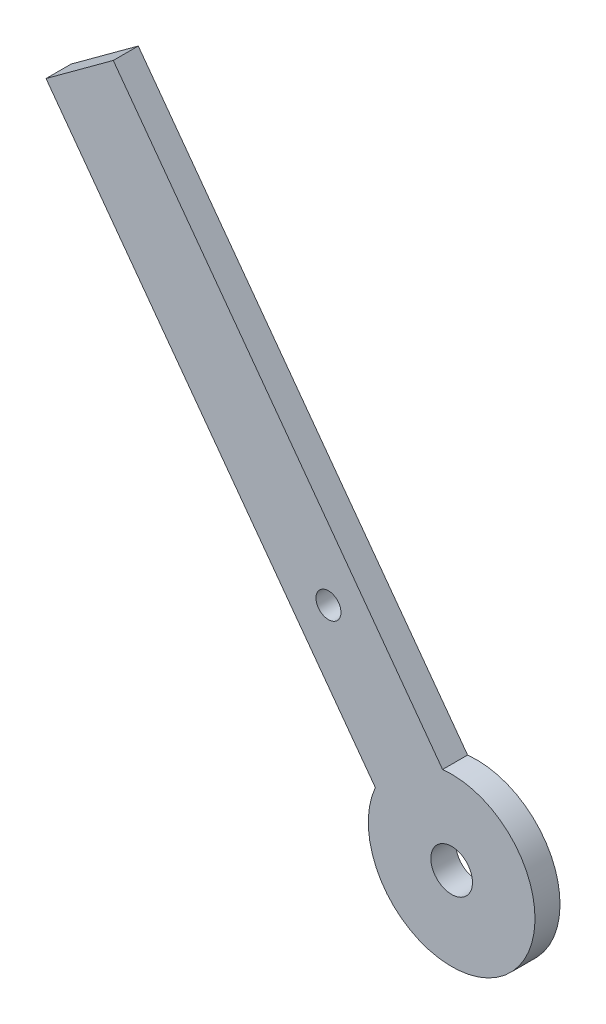
ISO-10303-21;
HEADER;
FILE_DESCRIPTION(('STEP AP214'),'2;1');
FILE_NAME('part.step','',(''),(''),'','','');
FILE_SCHEMA(('AUTOMOTIVE_DESIGN { 1 0 10303 214 1 1 1 1 }'));
ENDSEC;
DATA;
#1=APPLICATION_CONTEXT('core data for automotive mechanical design processes');
#2=APPLICATION_PROTOCOL_DEFINITION('international standard','automotive_design',2000,#1);
#3=PRODUCT_CONTEXT('',#1,'mechanical');
#4=PRODUCT('Part','Part','',(#3));
#5=PRODUCT_RELATED_PRODUCT_CATEGORY('part','',(#4));
#6=PRODUCT_DEFINITION_FORMATION('','',#4);
#7=PRODUCT_DEFINITION_CONTEXT('part definition',#1,'design');
#8=PRODUCT_DEFINITION('design','',#6,#7);
#9=PRODUCT_DEFINITION_SHAPE('','',#8);
#10=(LENGTH_UNIT() NAMED_UNIT(*) SI_UNIT(.MILLI.,.METRE.));
#11=(NAMED_UNIT(*) PLANE_ANGLE_UNIT() SI_UNIT($,.RADIAN.));
#12=(NAMED_UNIT(*) SI_UNIT($,.STERADIAN.) SOLID_ANGLE_UNIT());
#13=UNCERTAINTY_MEASURE_WITH_UNIT(LENGTH_MEASURE(1.E-05),#10,'distance_accuracy_value','');
#14=(GEOMETRIC_REPRESENTATION_CONTEXT(3) GLOBAL_UNCERTAINTY_ASSIGNED_CONTEXT((#13)) GLOBAL_UNIT_ASSIGNED_CONTEXT((#10,
#11,#12)) REPRESENTATION_CONTEXT('',''));
#15=CARTESIAN_POINT('',(0.,0.,0.));
#16=DIRECTION('',(0.,0.,1.));
#17=DIRECTION('',(1.,0.,0.));
#18=AXIS2_PLACEMENT_3D('',#15,#16,#17);
#19=CARTESIAN_POINT('',(52.8899948849438,53.8785527002225,3.));
#20=DIRECTION('',(0.,0.,1.));
#21=DIRECTION('',(1.,0.,0.));
#22=AXIS2_PLACEMENT_3D('',#19,#20,#21);
#23=PLANE('',#22);
#24=CARTESIAN_POINT('',(52.8899948849438,53.8785527002225,3.));
#25=DIRECTION('',(0.,0.,1.));
#26=DIRECTION('',(1.,0.,0.));
#27=AXIS2_PLACEMENT_3D('',#24,#25,#26);
#28=CIRCLE('',#27,2.49999999988457);
#29=CARTESIAN_POINT('',(55.3899948848284,53.8785527002225,3.));
#30=VERTEX_POINT('',#29);
#31=EDGE_CURVE('E101',#30,#30,#28,.T.);
#32=ORIENTED_EDGE('',*,*,#31,.F.);
#33=EDGE_LOOP('',(#32));
#34=FACE_BOUND('',#33,.T.);
#35=DIRECTION('',(-0.806588676447804,-0.591113108487859,0.));
#36=VECTOR('',#35,1.);
#37=CARTESIAN_POINT('',(8.26095519410983,114.775997772031,3.));
#38=LINE('',#37,#36);
#39=CARTESIAN_POINT('',(12.2938985763487,117.731563314471,3.));
#40=VERTEX_POINT('',#39);
#41=CARTESIAN_POINT('',(4.22801181186988,111.820432229591,3.));
#42=VERTEX_POINT('',#41);
#43=EDGE_CURVE('E81',#40,#42,#38,.T.);
#44=ORIENTED_EDGE('',*,*,#43,.T.);
#45=DIRECTION('',(0.591113108487865,-0.8065886764478,0.));
#46=VECTOR('',#45,1.);
#47=CARTESIAN_POINT('',(4.22801181186988,111.820432229591,3.));
#48=LINE('',#47,#46);
#49=CARTESIAN_POINT('',(43.7378618180995,57.9082499998685,3.));
#50=VERTEX_POINT('',#49);
#51=EDGE_CURVE('E84',#42,#50,#48,.T.);
#52=ORIENTED_EDGE('',*,*,#51,.T.);
#53=CARTESIAN_POINT('',(52.8899948849438,53.8785527002225,3.));
#54=DIRECTION('',(0.,0.,1.));
#55=DIRECTION('',(1.,0.,0.));
#56=AXIS2_PLACEMENT_3D('',#53,#54,#55);
#57=CIRCLE('',#56,10.);
#58=CARTESIAN_POINT('',(51.8037485825779,63.8193810847484,3.));
#59=VERTEX_POINT('',#58);
#60=EDGE_CURVE('E88',#50,#59,#57,.T.);
#61=ORIENTED_EDGE('',*,*,#60,.T.);
#62=DIRECTION('',(-0.591113108487866,0.806588676447799,0.));
#63=VECTOR('',#62,1.);
#64=CARTESIAN_POINT('',(12.2938985763487,117.731563314471,3.));
#65=LINE('',#64,#63);
#66=EDGE_CURVE('E52',#59,#40,#65,.T.);
#67=ORIENTED_EDGE('',*,*,#66,.T.);
#68=EDGE_LOOP('',(#44,#52,#61,#67));
#69=FACE_BOUND('',#68,.T.);
#70=CARTESIAN_POINT('',(38.1121671727473,74.0432696114173,3.));
#71=DIRECTION('',(0.,0.,1.));
#72=DIRECTION('',(1.,0.,0.));
#73=AXIS2_PLACEMENT_3D('',#70,#71,#72);
#74=CIRCLE('',#73,1.50000000177059);
#75=CARTESIAN_POINT('',(39.6121671745179,74.0432696114173,3.));
#76=VERTEX_POINT('',#75);
#77=EDGE_CURVE('E122',#76,#76,#74,.T.);
#78=ORIENTED_EDGE('',*,*,#77,.F.);
#79=EDGE_LOOP('',(#78));
#80=FACE_BOUND('',#79,.T.);
#81=ADVANCED_FACE('F35',(#34,#69,#80),#23,.T.);
#82=CARTESIAN_POINT('',(52.8899948849438,53.8785527002225,0.));
#83=DIRECTION('',(0.,0.,1.));
#84=DIRECTION('',(1.,0.,0.));
#85=AXIS2_PLACEMENT_3D('',#82,#83,#84);
#86=PLANE('',#85);
#87=DIRECTION('',(-0.806588676447799,-0.591113108487866,0.));
#88=VECTOR('',#87,1.);
#89=CARTESIAN_POINT('',(8.26095519410983,114.775997772031,0.));
#90=LINE('',#89,#88);
#91=CARTESIAN_POINT('',(12.2938985763487,117.731563314471,0.));
#92=VERTEX_POINT('',#91);
#93=CARTESIAN_POINT('',(4.22801181186988,111.820432229591,0.));
#94=VERTEX_POINT('',#93);
#95=EDGE_CURVE('E76',#92,#94,#90,.T.);
#96=ORIENTED_EDGE('',*,*,#95,.F.);
#97=DIRECTION('',(-0.591113108487866,0.806588676447799,0.));
#98=VECTOR('',#97,1.);
#99=CARTESIAN_POINT('',(12.2938985763487,117.731563314471,0.));
#100=LINE('',#99,#98);
#101=CARTESIAN_POINT('',(51.8037485825779,63.8193810847484,0.));
#102=VERTEX_POINT('',#101);
#103=EDGE_CURVE('E104',#102,#92,#100,.T.);
#104=ORIENTED_EDGE('',*,*,#103,.F.);
#105=CARTESIAN_POINT('',(52.8899948849438,53.8785527002225,0.));
#106=DIRECTION('',(0.,0.,1.));
#107=DIRECTION('',(1.,0.,0.));
#108=AXIS2_PLACEMENT_3D('',#105,#106,#107);
#109=CIRCLE('',#108,10.);
#110=CARTESIAN_POINT('',(43.7378618180995,57.9082499998685,0.));
#111=VERTEX_POINT('',#110);
#112=EDGE_CURVE('E69',#111,#102,#109,.T.);
#113=ORIENTED_EDGE('',*,*,#112,.F.);
#114=DIRECTION('',(0.591113108487865,-0.8065886764478,0.));
#115=VECTOR('',#114,1.);
#116=CARTESIAN_POINT('',(4.22801181186988,111.820432229591,0.));
#117=LINE('',#116,#115);
#118=EDGE_CURVE('E92',#94,#111,#117,.T.);
#119=ORIENTED_EDGE('',*,*,#118,.F.);
#120=EDGE_LOOP('',(#96,#104,#113,#119));
#121=FACE_BOUND('',#120,.T.);
#122=CARTESIAN_POINT('',(52.8899948849438,53.8785527002225,0.));
#123=DIRECTION('',(0.,0.,1.));
#124=DIRECTION('',(1.,0.,0.));
#125=AXIS2_PLACEMENT_3D('',#122,#123,#124);
#126=CIRCLE('',#125,2.49999999988457);
#127=CARTESIAN_POINT('',(55.3899948848284,53.8785527002225,0.));
#128=VERTEX_POINT('',#127);
#129=EDGE_CURVE('E117',#128,#128,#126,.T.);
#130=ORIENTED_EDGE('',*,*,#129,.T.);
#131=EDGE_LOOP('',(#130));
#132=FACE_BOUND('',#131,.T.);
#133=CARTESIAN_POINT('',(38.1121671727473,74.0432696114173,0.));
#134=DIRECTION('',(0.,0.,1.));
#135=DIRECTION('',(1.,0.,0.));
#136=AXIS2_PLACEMENT_3D('',#133,#134,#135);
#137=CIRCLE('',#136,1.50000000177059);
#138=CARTESIAN_POINT('',(39.6121671745179,74.0432696114173,0.));
#139=VERTEX_POINT('',#138);
#140=EDGE_CURVE('E120',#139,#139,#137,.T.);
#141=ORIENTED_EDGE('',*,*,#140,.T.);
#142=EDGE_LOOP('',(#141));
#143=FACE_BOUND('',#142,.T.);
#144=ADVANCED_FACE('F110',(#121,#132,#143),#86,.F.);
#145=CARTESIAN_POINT('',(8.26095519410983,114.775997772031,3.));
#146=DIRECTION('',(0.591113108487866,-0.806588676447799,0.));
#147=DIRECTION('',(0.806588676447799,0.591113108487866,0.));
#148=AXIS2_PLACEMENT_3D('',#145,#146,#147);
#149=PLANE('',#148);
#150=ORIENTED_EDGE('',*,*,#95,.T.);
#151=DIRECTION('',(0.,0.,-1.));
#152=VECTOR('',#151,1.);
#153=CARTESIAN_POINT('',(4.22801181186988,111.820432229591,3.));
#154=LINE('',#153,#152);
#155=EDGE_CURVE('E11',#42,#94,#154,.T.);
#156=ORIENTED_EDGE('',*,*,#155,.F.);
#157=ORIENTED_EDGE('',*,*,#43,.F.);
#158=DIRECTION('',(0.,0.,-1.));
#159=VECTOR('',#158,1.);
#160=CARTESIAN_POINT('',(12.2938985763487,117.731563314471,3.));
#161=LINE('',#160,#159);
#162=EDGE_CURVE('E96',#40,#92,#161,.T.);
#163=ORIENTED_EDGE('',*,*,#162,.T.);
#164=EDGE_LOOP('',(#150,#156,#157,#163));
#165=FACE_BOUND('',#164,.T.);
#166=ADVANCED_FACE('F37',(#165),#149,.F.);
#167=CARTESIAN_POINT('',(4.22801181186988,111.820432229591,3.));
#168=DIRECTION('',(0.8065886764478,0.591113108487865,0.));
#169=DIRECTION('',(-0.591113108487865,0.8065886764478,0.));
#170=AXIS2_PLACEMENT_3D('',#167,#168,#169);
#171=PLANE('',#170);
#172=ORIENTED_EDGE('',*,*,#118,.T.);
#173=DIRECTION('',(0.,0.,-1.));
#174=VECTOR('',#173,1.);
#175=CARTESIAN_POINT('',(43.7378618180995,57.9082499998685,3.));
#176=LINE('',#175,#174);
#177=EDGE_CURVE('E44',#50,#111,#176,.T.);
#178=ORIENTED_EDGE('',*,*,#177,.F.);
#179=ORIENTED_EDGE('',*,*,#51,.F.);
#180=ORIENTED_EDGE('',*,*,#155,.T.);
#181=EDGE_LOOP('',(#172,#178,#179,#180));
#182=FACE_BOUND('',#181,.T.);
#183=ADVANCED_FACE('F91',(#182),#171,.F.);
#184=CARTESIAN_POINT('',(52.8899948849438,53.8785527002225,3.));
#185=DIRECTION('',(0.,0.,-1.));
#186=DIRECTION('',(-1.,0.,0.));
#187=AXIS2_PLACEMENT_3D('',#184,#185,#186);
#188=CYLINDRICAL_SURFACE('',#187,10.);
#189=ORIENTED_EDGE('',*,*,#112,.T.);
#190=DIRECTION('',(0.,0.,-1.));
#191=VECTOR('',#190,1.);
#192=CARTESIAN_POINT('',(51.8037485825779,63.8193810847484,3.));
#193=LINE('',#192,#191);
#194=EDGE_CURVE('E93',#59,#102,#193,.T.);
#195=ORIENTED_EDGE('',*,*,#194,.F.);
#196=ORIENTED_EDGE('',*,*,#60,.F.);
#197=ORIENTED_EDGE('',*,*,#177,.T.);
#198=EDGE_LOOP('',(#189,#195,#196,#197));
#199=FACE_BOUND('',#198,.T.);
#200=ADVANCED_FACE('F94',(#199),#188,.T.);
#201=CARTESIAN_POINT('',(12.2938985763487,117.731563314471,3.));
#202=DIRECTION('',(-0.806588676447799,-0.591113108487866,0.));
#203=DIRECTION('',(0.591113108487866,-0.8065886764478,0.));
#204=AXIS2_PLACEMENT_3D('',#201,#202,#203);
#205=PLANE('',#204);
#206=ORIENTED_EDGE('',*,*,#103,.T.);
#207=ORIENTED_EDGE('',*,*,#162,.F.);
#208=ORIENTED_EDGE('',*,*,#66,.F.);
#209=ORIENTED_EDGE('',*,*,#194,.T.);
#210=EDGE_LOOP('',(#206,#207,#208,#209));
#211=FACE_BOUND('',#210,.T.);
#212=ADVANCED_FACE('F109',(#211),#205,.F.);
#213=CARTESIAN_POINT('',(52.8899948849438,53.8785527002225,3.));
#214=DIRECTION('',(0.,0.,-1.));
#215=DIRECTION('',(-1.,0.,0.));
#216=AXIS2_PLACEMENT_3D('',#213,#214,#215);
#217=CYLINDRICAL_SURFACE('',#216,2.49999999988457);
#218=ORIENTED_EDGE('',*,*,#31,.T.);
#219=EDGE_LOOP('',(#218));
#220=FACE_BOUND('',#219,.T.);
#221=ORIENTED_EDGE('',*,*,#129,.F.);
#222=EDGE_LOOP('',(#221));
#223=FACE_BOUND('',#222,.T.);
#224=ADVANCED_FACE('F131',(#220,#223),#217,.F.);
#225=CARTESIAN_POINT('',(38.1121671727473,74.0432696114173,3.));
#226=DIRECTION('',(0.,0.,-1.));
#227=DIRECTION('',(-1.,0.,0.));
#228=AXIS2_PLACEMENT_3D('',#225,#226,#227);
#229=CYLINDRICAL_SURFACE('',#228,1.50000000177059);
#230=ORIENTED_EDGE('',*,*,#77,.T.);
#231=EDGE_LOOP('',(#230));
#232=FACE_BOUND('',#231,.T.);
#233=ORIENTED_EDGE('',*,*,#140,.F.);
#234=EDGE_LOOP('',(#233));
#235=FACE_BOUND('',#234,.T.);
#236=ADVANCED_FACE('F188',(#232,#235),#229,.F.);
#237=CLOSED_SHELL('',(#81,#144,#166,#183,#200,#212,#224,#236));
#238=MANIFOLD_SOLID_BREP('B2',#237);
#239=ADVANCED_BREP_SHAPE_REPRESENTATION('',(#18,#238),#14);
#240=SHAPE_DEFINITION_REPRESENTATION(#9,#239);
ENDSEC;
END-ISO-10303-21;
